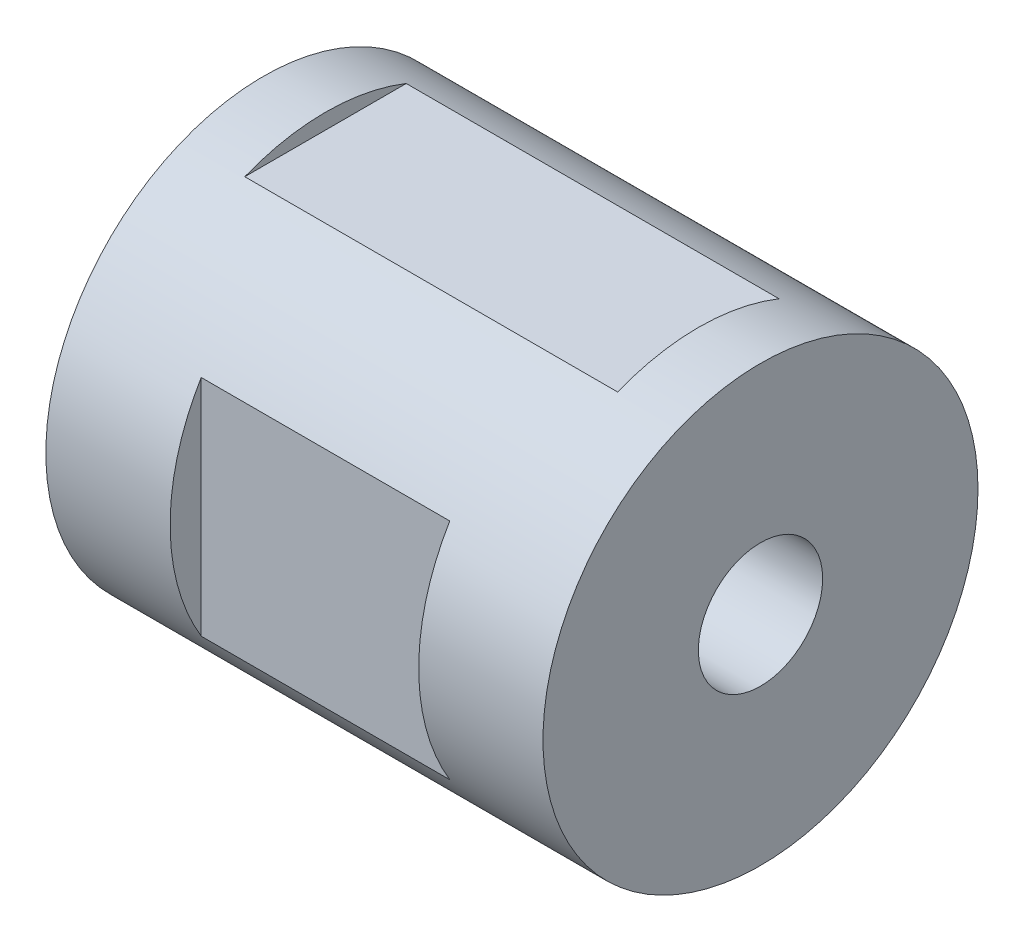
ISO-10303-21;
HEADER;
FILE_DESCRIPTION(('STEP AP214'),'2;1');
FILE_NAME('part.step','',(''),(''),'','','');
FILE_SCHEMA(('AUTOMOTIVE_DESIGN { 1 0 10303 214 1 1 1 1 }'));
ENDSEC;
DATA;
#1=APPLICATION_CONTEXT('core data for automotive mechanical design processes');
#2=APPLICATION_PROTOCOL_DEFINITION('international standard','automotive_design',2000,#1);
#3=PRODUCT_CONTEXT('',#1,'mechanical');
#4=PRODUCT('Part','Part','',(#3));
#5=PRODUCT_RELATED_PRODUCT_CATEGORY('part','',(#4));
#6=PRODUCT_DEFINITION_FORMATION('','',#4);
#7=PRODUCT_DEFINITION_CONTEXT('part definition',#1,'design');
#8=PRODUCT_DEFINITION('design','',#6,#7);
#9=PRODUCT_DEFINITION_SHAPE('','',#8);
#10=(LENGTH_UNIT() NAMED_UNIT(*) SI_UNIT(.MILLI.,.METRE.));
#11=(NAMED_UNIT(*) PLANE_ANGLE_UNIT() SI_UNIT($,.RADIAN.));
#12=(NAMED_UNIT(*) SI_UNIT($,.STERADIAN.) SOLID_ANGLE_UNIT());
#13=UNCERTAINTY_MEASURE_WITH_UNIT(LENGTH_MEASURE(1.E-05),#10,'distance_accuracy_value','');
#14=(GEOMETRIC_REPRESENTATION_CONTEXT(3) GLOBAL_UNCERTAINTY_ASSIGNED_CONTEXT((#13)) GLOBAL_UNIT_ASSIGNED_CONTEXT((#10,
#11,#12)) REPRESENTATION_CONTEXT('',''));
#15=CARTESIAN_POINT('',(0.,0.,0.));
#16=DIRECTION('',(0.,0.,1.));
#17=DIRECTION('',(1.,0.,0.));
#18=AXIS2_PLACEMENT_3D('',#15,#16,#17);
#19=CARTESIAN_POINT('',(-80.,0.,0.));
#20=DIRECTION('',(1.,0.,0.));
#21=DIRECTION('',(0.,0.,-1.));
#22=AXIS2_PLACEMENT_3D('',#19,#20,#21);
#23=CYLINDRICAL_SURFACE('',#22,35.);
#24=CARTESIAN_POINT('',(-80.,0.,0.));
#25=DIRECTION('',(1.,0.,0.));
#26=DIRECTION('',(0.,0.,-1.));
#27=AXIS2_PLACEMENT_3D('',#24,#25,#26);
#28=CIRCLE('',#27,35.);
#29=CARTESIAN_POINT('',(-80.,0.,-35.));
#30=VERTEX_POINT('',#29);
#31=EDGE_CURVE('E116',#30,#30,#28,.T.);
#32=ORIENTED_EDGE('',*,*,#31,.T.);
#33=EDGE_LOOP('',(#32));
#34=FACE_BOUND('',#33,.T.);
#35=CARTESIAN_POINT('',(0.,0.,0.));
#36=DIRECTION('',(1.,0.,0.));
#37=DIRECTION('',(0.,0.,-1.));
#38=AXIS2_PLACEMENT_3D('',#35,#36,#37);
#39=CIRCLE('',#38,35.);
#40=CARTESIAN_POINT('',(0.,0.,-35.));
#41=VERTEX_POINT('',#40);
#42=EDGE_CURVE('E117',#41,#41,#39,.T.);
#43=ORIENTED_EDGE('',*,*,#42,.F.);
#44=EDGE_LOOP('',(#43));
#45=FACE_BOUND('',#44,.T.);
#46=DIRECTION('',(1.,0.,0.));
#47=VECTOR('',#46,1.);
#48=CARTESIAN_POINT('',(-80.,32.5001523073354,12.99));
#49=LINE('',#48,#47);
#50=CARTESIAN_POINT('',(-10.,32.5001523073354,12.99));
#51=VERTEX_POINT('',#50);
#52=CARTESIAN_POINT('',(-70.,32.5001523073354,12.99));
#53=VERTEX_POINT('',#52);
#54=EDGE_CURVE('E107',#51,#53,#49,.F.);
#55=ORIENTED_EDGE('',*,*,#54,.T.);
#56=CARTESIAN_POINT('',(-70.,0.,0.));
#57=DIRECTION('',(1.,0.,0.));
#58=DIRECTION('',(0.,0.,-1.));
#59=AXIS2_PLACEMENT_3D('',#56,#57,#58);
#60=CIRCLE('',#59,35.);
#61=CARTESIAN_POINT('',(-70.,32.5001523073354,-12.99));
#62=VERTEX_POINT('',#61);
#63=EDGE_CURVE('E98',#53,#62,#60,.F.);
#64=ORIENTED_EDGE('',*,*,#63,.T.);
#65=DIRECTION('',(1.,0.,0.));
#66=VECTOR('',#65,1.);
#67=CARTESIAN_POINT('',(-80.,32.5001523073354,-12.99));
#68=LINE('',#67,#66);
#69=CARTESIAN_POINT('',(-9.99999999999999,32.5001523073354,-12.99));
#70=VERTEX_POINT('',#69);
#71=EDGE_CURVE('E113',#62,#70,#68,.T.);
#72=ORIENTED_EDGE('',*,*,#71,.T.);
#73=CARTESIAN_POINT('',(-9.99999999999999,0.,0.));
#74=DIRECTION('',(-1.,0.,0.));
#75=DIRECTION('',(0.,0.,1.));
#76=AXIS2_PLACEMENT_3D('',#73,#74,#75);
#77=CIRCLE('',#76,35.);
#78=EDGE_CURVE('E110',#70,#51,#77,.F.);
#79=ORIENTED_EDGE('',*,*,#78,.T.);
#80=EDGE_LOOP('',(#55,#64,#72,#79));
#81=FACE_BOUND('',#80,.T.);
#82=CARTESIAN_POINT('',(-20.,0.,0.));
#83=DIRECTION('',(-1.,0.,0.));
#84=DIRECTION('',(0.,-1.,0.));
#85=AXIS2_PLACEMENT_3D('',#82,#83,#84);
#86=CIRCLE('',#85,35.);
#87=CARTESIAN_POINT('',(-20.,18.02775637732,30.));
#88=VERTEX_POINT('',#87);
#89=CARTESIAN_POINT('',(-20.,-18.02775637732,30.));
#90=VERTEX_POINT('',#89);
#91=EDGE_CURVE('E97',#88,#90,#86,.F.);
#92=ORIENTED_EDGE('',*,*,#91,.T.);
#93=DIRECTION('',(1.,0.,0.));
#94=VECTOR('',#93,1.);
#95=CARTESIAN_POINT('',(-80.,-18.02775637732,30.));
#96=LINE('',#95,#94);
#97=CARTESIAN_POINT('',(-60.,-18.02775637732,30.));
#98=VERTEX_POINT('',#97);
#99=EDGE_CURVE('E11',#90,#98,#96,.F.);
#100=ORIENTED_EDGE('',*,*,#99,.T.);
#101=CARTESIAN_POINT('',(-60.,0.,0.));
#102=DIRECTION('',(1.,0.,0.));
#103=DIRECTION('',(0.,0.,-1.));
#104=AXIS2_PLACEMENT_3D('',#101,#102,#103);
#105=CIRCLE('',#104,35.);
#106=CARTESIAN_POINT('',(-60.,18.02775637732,30.));
#107=VERTEX_POINT('',#106);
#108=EDGE_CURVE('E46',#98,#107,#105,.F.);
#109=ORIENTED_EDGE('',*,*,#108,.T.);
#110=DIRECTION('',(1.,0.,0.));
#111=VECTOR('',#110,1.);
#112=CARTESIAN_POINT('',(-80.,18.02775637732,30.));
#113=LINE('',#112,#111);
#114=EDGE_CURVE('E90',#107,#88,#113,.T.);
#115=ORIENTED_EDGE('',*,*,#114,.T.);
#116=EDGE_LOOP('',(#92,#100,#109,#115));
#117=FACE_BOUND('',#116,.T.);
#118=ADVANCED_FACE('F39',(#34,#45,#81,#117),#23,.T.);
#119=CARTESIAN_POINT('',(-80.,0.,0.));
#120=DIRECTION('',(1.,0.,0.));
#121=DIRECTION('',(0.,0.,-1.));
#122=AXIS2_PLACEMENT_3D('',#119,#120,#121);
#123=PLANE('',#122);
#124=CARTESIAN_POINT('',(-80.,0.,0.));
#125=DIRECTION('',(1.,0.,0.));
#126=DIRECTION('',(0.,0.,-1.));
#127=AXIS2_PLACEMENT_3D('',#124,#125,#126);
#128=CIRCLE('',#127,10.);
#129=CARTESIAN_POINT('',(-80.,0.,-10.));
#130=VERTEX_POINT('',#129);
#131=EDGE_CURVE('E120',#130,#130,#128,.T.);
#132=ORIENTED_EDGE('',*,*,#131,.T.);
#133=EDGE_LOOP('',(#132));
#134=FACE_BOUND('',#133,.T.);
#135=ORIENTED_EDGE('',*,*,#31,.F.);
#136=EDGE_LOOP('',(#135));
#137=FACE_BOUND('',#136,.T.);
#138=ADVANCED_FACE('F172',(#134,#137),#123,.F.);
#139=CARTESIAN_POINT('',(0.,0.,0.));
#140=DIRECTION('',(1.,0.,0.));
#141=DIRECTION('',(0.,0.,-1.));
#142=AXIS2_PLACEMENT_3D('',#139,#140,#141);
#143=PLANE('',#142);
#144=CARTESIAN_POINT('',(0.,0.,0.));
#145=DIRECTION('',(1.,0.,0.));
#146=DIRECTION('',(0.,0.,-1.));
#147=AXIS2_PLACEMENT_3D('',#144,#145,#146);
#148=CIRCLE('',#147,10.);
#149=CARTESIAN_POINT('',(0.,0.,-10.));
#150=VERTEX_POINT('',#149);
#151=EDGE_CURVE('E123',#150,#150,#148,.T.);
#152=ORIENTED_EDGE('',*,*,#151,.F.);
#153=EDGE_LOOP('',(#152));
#154=FACE_BOUND('',#153,.T.);
#155=ORIENTED_EDGE('',*,*,#42,.T.);
#156=EDGE_LOOP('',(#155));
#157=FACE_BOUND('',#156,.T.);
#158=ADVANCED_FACE('F177',(#154,#157),#143,.T.);
#159=CARTESIAN_POINT('',(-80.,0.,0.));
#160=DIRECTION('',(1.,0.,0.));
#161=DIRECTION('',(0.,0.,-1.));
#162=AXIS2_PLACEMENT_3D('',#159,#160,#161);
#163=CYLINDRICAL_SURFACE('',#162,10.);
#164=ORIENTED_EDGE('',*,*,#131,.F.);
#165=EDGE_LOOP('',(#164));
#166=FACE_BOUND('',#165,.T.);
#167=ORIENTED_EDGE('',*,*,#151,.T.);
#168=EDGE_LOOP('',(#167));
#169=FACE_BOUND('',#168,.T.);
#170=ADVANCED_FACE('F185',(#166,#169),#163,.F.);
#171=CARTESIAN_POINT('',(-70.,42.5,-12.99));
#172=DIRECTION('',(1.,0.,0.));
#173=DIRECTION('',(0.,0.,-1.));
#174=AXIS2_PLACEMENT_3D('',#171,#172,#173);
#175=PLANE('',#174);
#176=DIRECTION('',(0.,-1.,0.));
#177=VECTOR('',#176,1.);
#178=CARTESIAN_POINT('',(-70.,42.5,12.99));
#179=LINE('',#178,#177);
#180=CARTESIAN_POINT('',(-70.,32.5,12.99));
#181=VERTEX_POINT('',#180);
#182=EDGE_CURVE('E126',#53,#181,#179,.T.);
#183=ORIENTED_EDGE('',*,*,#182,.T.);
#184=DIRECTION('',(0.,0.,1.));
#185=VECTOR('',#184,1.);
#186=CARTESIAN_POINT('',(-70.,32.5,-12.99));
#187=LINE('',#186,#185);
#188=CARTESIAN_POINT('',(-70.,32.5,-12.99));
#189=VERTEX_POINT('',#188);
#190=EDGE_CURVE('E144',#189,#181,#187,.T.);
#191=ORIENTED_EDGE('',*,*,#190,.F.);
#192=DIRECTION('',(0.,-1.,0.));
#193=VECTOR('',#192,1.);
#194=CARTESIAN_POINT('',(-70.,42.5,-12.99));
#195=LINE('',#194,#193);
#196=EDGE_CURVE('E133',#62,#189,#195,.T.);
#197=ORIENTED_EDGE('',*,*,#196,.F.);
#198=ORIENTED_EDGE('',*,*,#63,.F.);
#199=EDGE_LOOP('',(#183,#191,#197,#198));
#200=FACE_BOUND('',#199,.T.);
#201=ADVANCED_FACE('F154',(#200),#175,.T.);
#202=CARTESIAN_POINT('',(-70.,42.5,12.99));
#203=DIRECTION('',(0.,0.,-1.));
#204=DIRECTION('',(-1.,0.,0.));
#205=AXIS2_PLACEMENT_3D('',#202,#203,#204);
#206=PLANE('',#205);
#207=DIRECTION('',(0.,-1.,0.));
#208=VECTOR('',#207,1.);
#209=CARTESIAN_POINT('',(-10.,42.5,12.99));
#210=LINE('',#209,#208);
#211=CARTESIAN_POINT('',(-10.,32.5,12.99));
#212=VERTEX_POINT('',#211);
#213=EDGE_CURVE('E130',#51,#212,#210,.T.);
#214=ORIENTED_EDGE('',*,*,#213,.T.);
#215=DIRECTION('',(1.,0.,0.));
#216=VECTOR('',#215,1.);
#217=CARTESIAN_POINT('',(-70.,32.5,12.99));
#218=LINE('',#217,#216);
#219=EDGE_CURVE('E141',#181,#212,#218,.T.);
#220=ORIENTED_EDGE('',*,*,#219,.F.);
#221=ORIENTED_EDGE('',*,*,#182,.F.);
#222=ORIENTED_EDGE('',*,*,#54,.F.);
#223=EDGE_LOOP('',(#214,#220,#221,#222));
#224=FACE_BOUND('',#223,.T.);
#225=ADVANCED_FACE('F157',(#224),#206,.T.);
#226=CARTESIAN_POINT('',(-10.,42.5,-12.99));
#227=DIRECTION('',(-1.,0.,0.));
#228=DIRECTION('',(0.,0.,1.));
#229=AXIS2_PLACEMENT_3D('',#226,#227,#228);
#230=PLANE('',#229);
#231=DIRECTION('',(0.,-1.,0.));
#232=VECTOR('',#231,1.);
#233=CARTESIAN_POINT('',(-10.,42.5,-12.99));
#234=LINE('',#233,#232);
#235=CARTESIAN_POINT('',(-10.,32.5,-12.99));
#236=VERTEX_POINT('',#235);
#237=EDGE_CURVE('E61',#70,#236,#234,.T.);
#238=ORIENTED_EDGE('',*,*,#237,.T.);
#239=DIRECTION('',(0.,0.,-1.));
#240=VECTOR('',#239,1.);
#241=CARTESIAN_POINT('',(-10.,32.5,-12.99));
#242=LINE('',#241,#240);
#243=EDGE_CURVE('E138',#212,#236,#242,.T.);
#244=ORIENTED_EDGE('',*,*,#243,.F.);
#245=ORIENTED_EDGE('',*,*,#213,.F.);
#246=ORIENTED_EDGE('',*,*,#78,.F.);
#247=EDGE_LOOP('',(#238,#244,#245,#246));
#248=FACE_BOUND('',#247,.T.);
#249=ADVANCED_FACE('F160',(#248),#230,.T.);
#250=CARTESIAN_POINT('',(-70.,42.5,-12.99));
#251=DIRECTION('',(0.,0.,1.));
#252=DIRECTION('',(1.,0.,0.));
#253=AXIS2_PLACEMENT_3D('',#250,#251,#252);
#254=PLANE('',#253);
#255=ORIENTED_EDGE('',*,*,#196,.T.);
#256=DIRECTION('',(-1.,0.,0.));
#257=VECTOR('',#256,1.);
#258=CARTESIAN_POINT('',(-70.,32.5,-12.99));
#259=LINE('',#258,#257);
#260=EDGE_CURVE('E135',#236,#189,#259,.T.);
#261=ORIENTED_EDGE('',*,*,#260,.F.);
#262=ORIENTED_EDGE('',*,*,#237,.F.);
#263=ORIENTED_EDGE('',*,*,#71,.F.);
#264=EDGE_LOOP('',(#255,#261,#262,#263));
#265=FACE_BOUND('',#264,.T.);
#266=ADVANCED_FACE('F162',(#265),#254,.T.);
#267=CARTESIAN_POINT('',(0.,32.5,0.));
#268=DIRECTION('',(0.,1.,0.));
#269=DIRECTION('',(0.,0.,1.));
#270=AXIS2_PLACEMENT_3D('',#267,#268,#269);
#271=PLANE('',#270);
#272=ORIENTED_EDGE('',*,*,#190,.T.);
#273=ORIENTED_EDGE('',*,*,#219,.T.);
#274=ORIENTED_EDGE('',*,*,#243,.T.);
#275=ORIENTED_EDGE('',*,*,#260,.T.);
#276=EDGE_LOOP('',(#272,#273,#274,#275));
#277=FACE_BOUND('',#276,.T.);
#278=ADVANCED_FACE('F149',(#277),#271,.T.);
#279=CARTESIAN_POINT('',(-60.,18.03,40.));
#280=DIRECTION('',(1.,0.,0.));
#281=DIRECTION('',(0.,0.,-1.));
#282=AXIS2_PLACEMENT_3D('',#279,#280,#281);
#283=PLANE('',#282);
#284=DIRECTION('',(0.,-1.,0.));
#285=VECTOR('',#284,1.);
#286=CARTESIAN_POINT('',(-60.,18.03,30.));
#287=LINE('',#286,#285);
#288=EDGE_CURVE('E93',#107,#98,#287,.T.);
#289=ORIENTED_EDGE('',*,*,#288,.F.);
#290=ORIENTED_EDGE('',*,*,#108,.F.);
#291=EDGE_LOOP('',(#289,#290));
#292=FACE_BOUND('',#291,.T.);
#293=ADVANCED_FACE('F101',(#292),#283,.T.);
#294=CARTESIAN_POINT('',(-20.,18.03,40.));
#295=DIRECTION('',(-1.,0.,0.));
#296=DIRECTION('',(0.,-1.,0.));
#297=AXIS2_PLACEMENT_3D('',#294,#295,#296);
#298=PLANE('',#297);
#299=DIRECTION('',(0.,1.,0.));
#300=VECTOR('',#299,1.);
#301=CARTESIAN_POINT('',(-20.,18.03,30.));
#302=LINE('',#301,#300);
#303=EDGE_CURVE('E53',#90,#88,#302,.T.);
#304=ORIENTED_EDGE('',*,*,#303,.F.);
#305=ORIENTED_EDGE('',*,*,#91,.F.);
#306=EDGE_LOOP('',(#304,#305));
#307=FACE_BOUND('',#306,.T.);
#308=ADVANCED_FACE('F225',(#307),#298,.T.);
#309=CARTESIAN_POINT('',(0.,0.,30.));
#310=DIRECTION('',(0.,0.,1.));
#311=DIRECTION('',(1.,0.,0.));
#312=AXIS2_PLACEMENT_3D('',#309,#310,#311);
#313=PLANE('',#312);
#314=ORIENTED_EDGE('',*,*,#303,.T.);
#315=ORIENTED_EDGE('',*,*,#114,.F.);
#316=ORIENTED_EDGE('',*,*,#288,.T.);
#317=ORIENTED_EDGE('',*,*,#99,.F.);
#318=EDGE_LOOP('',(#314,#315,#316,#317));
#319=FACE_BOUND('',#318,.T.);
#320=ADVANCED_FACE('F92',(#319),#313,.T.);
#321=CLOSED_SHELL('',(#118,#138,#158,#170,#201,#225,#249,#266,#278,#293,#308,#320));
#322=MANIFOLD_SOLID_BREP('B2',#321);
#323=ADVANCED_BREP_SHAPE_REPRESENTATION('',(#18,#322),#14);
#324=SHAPE_DEFINITION_REPRESENTATION(#9,#323);
ENDSEC;
END-ISO-10303-21;
